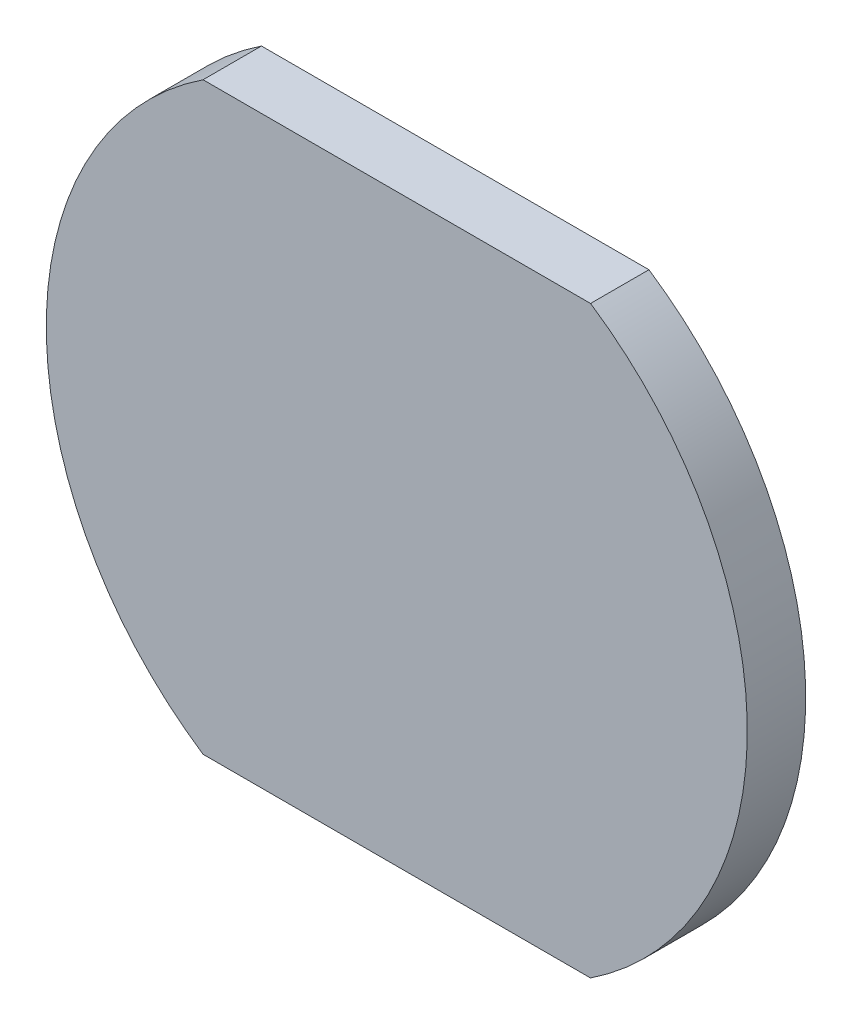
ISO-10303-21;
HEADER;
FILE_DESCRIPTION(('STEP AP214'),'2;1');
FILE_NAME('part.step','',(''),(''),'','','');
FILE_SCHEMA(('AUTOMOTIVE_DESIGN { 1 0 10303 214 1 1 1 1 }'));
ENDSEC;
DATA;
#1=APPLICATION_CONTEXT('core data for automotive mechanical design processes');
#2=APPLICATION_PROTOCOL_DEFINITION('international standard','automotive_design',2000,#1);
#3=PRODUCT_CONTEXT('',#1,'mechanical');
#4=PRODUCT('Part','Part','',(#3));
#5=PRODUCT_RELATED_PRODUCT_CATEGORY('part','',(#4));
#6=PRODUCT_DEFINITION_FORMATION('','',#4);
#7=PRODUCT_DEFINITION_CONTEXT('part definition',#1,'design');
#8=PRODUCT_DEFINITION('design','',#6,#7);
#9=PRODUCT_DEFINITION_SHAPE('','',#8);
#10=(LENGTH_UNIT() NAMED_UNIT(*) SI_UNIT(.MILLI.,.METRE.));
#11=(NAMED_UNIT(*) PLANE_ANGLE_UNIT() SI_UNIT($,.RADIAN.));
#12=(NAMED_UNIT(*) SI_UNIT($,.STERADIAN.) SOLID_ANGLE_UNIT());
#13=UNCERTAINTY_MEASURE_WITH_UNIT(LENGTH_MEASURE(1.E-05),#10,'distance_accuracy_value','');
#14=(GEOMETRIC_REPRESENTATION_CONTEXT(3) GLOBAL_UNCERTAINTY_ASSIGNED_CONTEXT((#13)) GLOBAL_UNIT_ASSIGNED_CONTEXT((#10,
#11,#12)) REPRESENTATION_CONTEXT('',''));
#15=CARTESIAN_POINT('',(0.,0.,0.));
#16=DIRECTION('',(0.,0.,1.));
#17=DIRECTION('',(1.,0.,0.));
#18=AXIS2_PLACEMENT_3D('',#15,#16,#17);
#19=CARTESIAN_POINT('',(2.5,0.,-1.2));
#20=DIRECTION('',(0.,0.,1.));
#21=DIRECTION('',(0.,-1.,0.));
#22=AXIS2_PLACEMENT_3D('',#19,#20,#21);
#23=PLANE('',#22);
#24=CARTESIAN_POINT('',(0.,0.,-1.2));
#25=DIRECTION('',(0.,0.,1.));
#26=DIRECTION('',(0.,-1.,0.));
#27=AXIS2_PLACEMENT_3D('',#24,#25,#26);
#28=CIRCLE('',#27,2.5);
#29=CARTESIAN_POINT('',(0.,-2.5,-1.2));
#30=VERTEX_POINT('',#29);
#31=EDGE_CURVE('E19',#30,#30,#28,.T.);
#32=ORIENTED_EDGE('',*,*,#31,.F.);
#33=EDGE_LOOP('',(#32));
#34=FACE_BOUND('',#33,.T.);
#35=ADVANCED_FACE('F16',(#34),#23,.F.);
#36=CARTESIAN_POINT('',(0.,0.,0.));
#37=DIRECTION('',(0.,0.,1.));
#38=DIRECTION('',(0.,-1.,0.));
#39=AXIS2_PLACEMENT_3D('',#36,#37,#38);
#40=CYLINDRICAL_SURFACE('',#39,2.5);
#41=ORIENTED_EDGE('',*,*,#31,.T.);
#42=EDGE_LOOP('',(#41));
#43=FACE_BOUND('',#42,.T.);
#44=CARTESIAN_POINT('',(0.,0.,0.));
#45=DIRECTION('',(0.,0.,1.));
#46=DIRECTION('',(0.,-1.,0.));
#47=AXIS2_PLACEMENT_3D('',#44,#45,#46);
#48=CIRCLE('',#47,2.5);
#49=CARTESIAN_POINT('',(0.,-2.5,0.));
#50=VERTEX_POINT('',#49);
#51=EDGE_CURVE('E66',#50,#50,#48,.T.);
#52=ORIENTED_EDGE('',*,*,#51,.F.);
#53=EDGE_LOOP('',(#52));
#54=FACE_BOUND('',#53,.T.);
#55=ADVANCED_FACE('F93',(#43,#54),#40,.T.);
#56=CARTESIAN_POINT('',(-3.316624790356,-5.,0.));
#57=DIRECTION('',(0.,0.,-1.));
#58=DIRECTION('',(0.,1.,0.));
#59=AXIS2_PLACEMENT_3D('',#56,#57,#58);
#60=PLANE('',#59);
#61=ORIENTED_EDGE('',*,*,#51,.T.);
#62=EDGE_LOOP('',(#61));
#63=FACE_BOUND('',#62,.T.);
#64=DIRECTION('',(1.,0.,0.));
#65=VECTOR('',#64,1.);
#66=CARTESIAN_POINT('',(3.316624790356,5.,0.));
#67=LINE('',#66,#65);
#68=CARTESIAN_POINT('',(-3.3166247903557,5.,0.));
#69=VERTEX_POINT('',#68);
#70=CARTESIAN_POINT('',(3.31662479035561,4.99999999999986,0.));
#71=VERTEX_POINT('',#70);
#72=EDGE_CURVE('E58',#69,#71,#67,.T.);
#73=ORIENTED_EDGE('',*,*,#72,.T.);
#74=CARTESIAN_POINT('',(0.,0.,0.));
#75=DIRECTION('',(0.,0.,-1.));
#76=DIRECTION('',(0.,1.,0.));
#77=AXIS2_PLACEMENT_3D('',#74,#75,#76);
#78=CIRCLE('',#77,6.);
#79=CARTESIAN_POINT('',(3.3166247903557,-5.,0.));
#80=VERTEX_POINT('',#79);
#81=EDGE_CURVE('E73',#80,#71,#78,.F.);
#82=ORIENTED_EDGE('',*,*,#81,.F.);
#83=DIRECTION('',(1.,0.,0.));
#84=VECTOR('',#83,1.);
#85=CARTESIAN_POINT('',(-3.316624790356,-5.,0.));
#86=LINE('',#85,#84);
#87=CARTESIAN_POINT('',(-3.3166247903557,-5.,0.));
#88=VERTEX_POINT('',#87);
#89=EDGE_CURVE('E60',#80,#88,#86,.F.);
#90=ORIENTED_EDGE('',*,*,#89,.T.);
#91=CARTESIAN_POINT('',(0.,0.,0.));
#92=DIRECTION('',(0.,0.,-1.));
#93=DIRECTION('',(0.,1.,0.));
#94=AXIS2_PLACEMENT_3D('',#91,#92,#93);
#95=CIRCLE('',#94,6.);
#96=EDGE_CURVE('E55',#69,#88,#95,.F.);
#97=ORIENTED_EDGE('',*,*,#96,.F.);
#98=EDGE_LOOP('',(#73,#82,#90,#97));
#99=FACE_BOUND('',#98,.T.);
#100=ADVANCED_FACE('F57',(#63,#99),#60,.T.);
#101=CARTESIAN_POINT('',(0.,0.,0.));
#102=DIRECTION('',(0.,0.,-1.));
#103=DIRECTION('',(0.,1.,0.));
#104=AXIS2_PLACEMENT_3D('',#101,#102,#103);
#105=CYLINDRICAL_SURFACE('',#104,6.);
#106=CARTESIAN_POINT('',(0.,0.,0.999999999999996));
#107=DIRECTION('',(0.,0.,-1.));
#108=DIRECTION('',(0.,1.,0.));
#109=AXIS2_PLACEMENT_3D('',#106,#107,#108);
#110=CIRCLE('',#109,6.);
#111=CARTESIAN_POINT('',(-3.3166247903557,-5.,1.));
#112=VERTEX_POINT('',#111);
#113=CARTESIAN_POINT('',(-3.3166247903557,5.,0.999999999999991));
#114=VERTEX_POINT('',#113);
#115=EDGE_CURVE('E77',#112,#114,#110,.T.);
#116=ORIENTED_EDGE('',*,*,#115,.T.);
#117=DIRECTION('',(0.,0.,-1.));
#118=VECTOR('',#117,1.);
#119=CARTESIAN_POINT('',(-3.316624790356,5.,0.));
#120=LINE('',#119,#118);
#121=EDGE_CURVE('E65',#114,#69,#120,.T.);
#122=ORIENTED_EDGE('',*,*,#121,.T.);
#123=ORIENTED_EDGE('',*,*,#96,.T.);
#124=DIRECTION('',(0.,0.,1.));
#125=VECTOR('',#124,1.);
#126=CARTESIAN_POINT('',(-3.316624790356,-5.,0.));
#127=LINE('',#126,#125);
#128=EDGE_CURVE('E174',#88,#112,#127,.T.);
#129=ORIENTED_EDGE('',*,*,#128,.T.);
#130=EDGE_LOOP('',(#116,#122,#123,#129));
#131=FACE_BOUND('',#130,.T.);
#132=ADVANCED_FACE('F76',(#131),#105,.T.);
#133=CARTESIAN_POINT('',(3.316624790356,5.,0.));
#134=DIRECTION('',(0.,-1.,0.));
#135=DIRECTION('',(0.,0.,-1.));
#136=AXIS2_PLACEMENT_3D('',#133,#134,#135);
#137=PLANE('',#136);
#138=ORIENTED_EDGE('',*,*,#121,.F.);
#139=DIRECTION('',(1.,0.,0.));
#140=VECTOR('',#139,1.);
#141=CARTESIAN_POINT('',(-3.316624790356,5.,0.999999999999991));
#142=LINE('',#141,#140);
#143=CARTESIAN_POINT('',(3.31662479035561,4.99999999999986,1.));
#144=VERTEX_POINT('',#143);
#145=EDGE_CURVE('E85',#114,#144,#142,.T.);
#146=ORIENTED_EDGE('',*,*,#145,.T.);
#147=DIRECTION('',(0.,0.,-1.));
#148=VECTOR('',#147,1.);
#149=CARTESIAN_POINT('',(3.31662479035582,4.99999999999972,0.));
#150=LINE('',#149,#148);
#151=EDGE_CURVE('E72',#71,#144,#150,.F.);
#152=ORIENTED_EDGE('',*,*,#151,.F.);
#153=ORIENTED_EDGE('',*,*,#72,.F.);
#154=EDGE_LOOP('',(#138,#146,#152,#153));
#155=FACE_BOUND('',#154,.T.);
#156=ADVANCED_FACE('F69',(#155),#137,.F.);
#157=CARTESIAN_POINT('',(0.,0.,0.));
#158=DIRECTION('',(0.,0.,-1.));
#159=DIRECTION('',(0.,1.,0.));
#160=AXIS2_PLACEMENT_3D('',#157,#158,#159);
#161=CYLINDRICAL_SURFACE('',#160,6.);
#162=CARTESIAN_POINT('',(0.,0.,1.));
#163=DIRECTION('',(0.,0.,-1.));
#164=DIRECTION('',(0.,1.,0.));
#165=AXIS2_PLACEMENT_3D('',#162,#163,#164);
#166=CIRCLE('',#165,6.);
#167=CARTESIAN_POINT('',(3.3166247903557,-5.,1.));
#168=VERTEX_POINT('',#167);
#169=EDGE_CURVE('E25',#144,#168,#166,.T.);
#170=ORIENTED_EDGE('',*,*,#169,.T.);
#171=DIRECTION('',(0.,0.,1.));
#172=VECTOR('',#171,1.);
#173=CARTESIAN_POINT('',(3.316624790356,-5.,0.));
#174=LINE('',#173,#172);
#175=EDGE_CURVE('E33',#168,#80,#174,.F.);
#176=ORIENTED_EDGE('',*,*,#175,.T.);
#177=ORIENTED_EDGE('',*,*,#81,.T.);
#178=ORIENTED_EDGE('',*,*,#151,.T.);
#179=EDGE_LOOP('',(#170,#176,#177,#178));
#180=FACE_BOUND('',#179,.T.);
#181=ADVANCED_FACE('F109',(#180),#161,.T.);
#182=CARTESIAN_POINT('',(-3.316624790356,-5.,0.));
#183=DIRECTION('',(0.,1.,0.));
#184=DIRECTION('',(0.,0.,1.));
#185=AXIS2_PLACEMENT_3D('',#182,#183,#184);
#186=PLANE('',#185);
#187=ORIENTED_EDGE('',*,*,#175,.F.);
#188=DIRECTION('',(1.,0.,0.));
#189=VECTOR('',#188,1.);
#190=CARTESIAN_POINT('',(-3.316624790356,-5.,1.));
#191=LINE('',#190,#189);
#192=EDGE_CURVE('E10',#168,#112,#191,.F.);
#193=ORIENTED_EDGE('',*,*,#192,.T.);
#194=ORIENTED_EDGE('',*,*,#128,.F.);
#195=ORIENTED_EDGE('',*,*,#89,.F.);
#196=EDGE_LOOP('',(#187,#193,#194,#195));
#197=FACE_BOUND('',#196,.T.);
#198=ADVANCED_FACE('F103',(#197),#186,.F.);
#199=CARTESIAN_POINT('',(-3.316624790356,-5.,1.));
#200=DIRECTION('',(0.,0.,-1.));
#201=DIRECTION('',(0.,1.,0.));
#202=AXIS2_PLACEMENT_3D('',#199,#200,#201);
#203=PLANE('',#202);
#204=ORIENTED_EDGE('',*,*,#169,.F.);
#205=ORIENTED_EDGE('',*,*,#145,.F.);
#206=ORIENTED_EDGE('',*,*,#115,.F.);
#207=ORIENTED_EDGE('',*,*,#192,.F.);
#208=EDGE_LOOP('',(#204,#205,#206,#207));
#209=FACE_BOUND('',#208,.T.);
#210=ADVANCED_FACE('F101',(#209),#203,.F.);
#211=CLOSED_SHELL('',(#35,#55,#100,#132,#156,#181,#198,#210));
#212=MANIFOLD_SOLID_BREP('B1',#211);
#213=ADVANCED_BREP_SHAPE_REPRESENTATION('',(#18,#212),#14);
#214=SHAPE_DEFINITION_REPRESENTATION(#9,#213);
ENDSEC;
END-ISO-10303-21;
